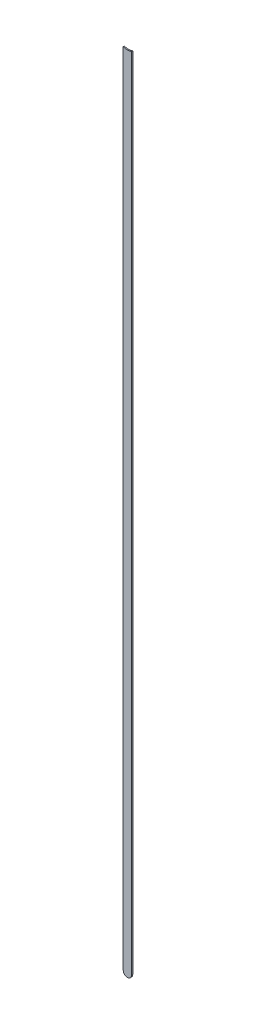
ISO-10303-21;
HEADER;
FILE_DESCRIPTION(('STEP AP214'),'2;1');
FILE_NAME('part.step','',(''),(''),'','','');
FILE_SCHEMA(('AUTOMOTIVE_DESIGN { 1 0 10303 214 1 1 1 1 }'));
ENDSEC;
DATA;
#1=APPLICATION_CONTEXT('core data for automotive mechanical design processes');
#2=APPLICATION_PROTOCOL_DEFINITION('international standard','automotive_design',2000,#1);
#3=PRODUCT_CONTEXT('',#1,'mechanical');
#4=PRODUCT('Part','Part','',(#3));
#5=PRODUCT_RELATED_PRODUCT_CATEGORY('part','',(#4));
#6=PRODUCT_DEFINITION_FORMATION('','',#4);
#7=PRODUCT_DEFINITION_CONTEXT('part definition',#1,'design');
#8=PRODUCT_DEFINITION('design','',#6,#7);
#9=PRODUCT_DEFINITION_SHAPE('','',#8);
#10=(LENGTH_UNIT() NAMED_UNIT(*) SI_UNIT(.MILLI.,.METRE.));
#11=(NAMED_UNIT(*) PLANE_ANGLE_UNIT() SI_UNIT($,.RADIAN.));
#12=(NAMED_UNIT(*) SI_UNIT($,.STERADIAN.) SOLID_ANGLE_UNIT());
#13=UNCERTAINTY_MEASURE_WITH_UNIT(LENGTH_MEASURE(1.E-05),#10,'distance_accuracy_value','');
#14=(GEOMETRIC_REPRESENTATION_CONTEXT(3) GLOBAL_UNCERTAINTY_ASSIGNED_CONTEXT((#13)) GLOBAL_UNIT_ASSIGNED_CONTEXT((#10,
#11,#12)) REPRESENTATION_CONTEXT('',''));
#15=CARTESIAN_POINT('',(0.,0.,0.));
#16=DIRECTION('',(0.,0.,1.));
#17=DIRECTION('',(1.,0.,0.));
#18=AXIS2_PLACEMENT_3D('',#15,#16,#17);
#19=CARTESIAN_POINT('',(90.34397222,59.48697526,0.));
#20=DIRECTION('',(-1.,0.,0.));
#21=DIRECTION('',(0.,1.,0.));
#22=AXIS2_PLACEMENT_3D('',#19,#20,#21);
#23=PLANE('',#22);
#24=DIRECTION('',(0.,1.,0.));
#25=VECTOR('',#24,1.);
#26=CARTESIAN_POINT('',(90.34397222,59.48697526,0.03556));
#27=LINE('',#26,#25);
#28=CARTESIAN_POINT('',(90.34397222,59.48697526,0.03556));
#29=VERTEX_POINT('',#28);
#30=CARTESIAN_POINT('',(90.34397222,83.8548234805022,0.03556));
#31=VERTEX_POINT('',#30);
#32=EDGE_CURVE('E11',#29,#31,#27,.T.);
#33=ORIENTED_EDGE('',*,*,#32,.F.);
#34=DIRECTION('',(0.,0.,1.));
#35=VECTOR('',#34,1.);
#36=CARTESIAN_POINT('',(90.34397222,59.48697526,0.));
#37=LINE('',#36,#35);
#38=CARTESIAN_POINT('',(90.34397222,59.48697526,0.));
#39=VERTEX_POINT('',#38);
#40=EDGE_CURVE('E24',#39,#29,#37,.T.);
#41=ORIENTED_EDGE('',*,*,#40,.F.);
#42=DIRECTION('',(0.,1.,0.));
#43=VECTOR('',#42,1.);
#44=CARTESIAN_POINT('',(90.34397222,59.48697526,0.));
#45=LINE('',#44,#43);
#46=CARTESIAN_POINT('',(90.34397222,83.8548234805022,0.));
#47=VERTEX_POINT('',#46);
#48=EDGE_CURVE('E75',#39,#47,#45,.T.);
#49=ORIENTED_EDGE('',*,*,#48,.T.);
#50=DIRECTION('',(0.,0.,1.));
#51=VECTOR('',#50,1.);
#52=CARTESIAN_POINT('',(90.34397222,83.8548234805022,0.));
#53=LINE('',#52,#51);
#54=EDGE_CURVE('E37',#47,#31,#53,.T.);
#55=ORIENTED_EDGE('',*,*,#54,.T.);
#56=EDGE_LOOP('',(#33,#41,#49,#55));
#57=FACE_BOUND('',#56,.T.);
#58=ADVANCED_FACE('F17',(#57),#23,.F.);
#59=CARTESIAN_POINT('',(90.21697222,84.18697158,0.));
#60=DIRECTION('',(0.,0.,-1.));
#61=DIRECTION('',(1.,0.,0.));
#62=AXIS2_PLACEMENT_3D('',#59,#60,#61);
#63=CYLINDRICAL_SURFACE('',#62,0.3556);
#64=DIRECTION('',(0.,0.,1.));
#65=VECTOR('',#64,1.);
#66=CARTESIAN_POINT('',(90.08997222,83.8548234805022,0.));
#67=LINE('',#66,#65);
#68=CARTESIAN_POINT('',(90.08997222,83.8548234805022,0.));
#69=VERTEX_POINT('',#68);
#70=CARTESIAN_POINT('',(90.08997222,83.8548234805022,0.03556));
#71=VERTEX_POINT('',#70);
#72=EDGE_CURVE('E67',#69,#71,#67,.T.);
#73=ORIENTED_EDGE('',*,*,#72,.T.);
#74=CARTESIAN_POINT('',(90.21697222,84.18697158,0.03556));
#75=DIRECTION('',(0.,0.,1.));
#76=DIRECTION('',(1.,0.,0.));
#77=AXIS2_PLACEMENT_3D('',#74,#75,#76);
#78=CIRCLE('',#77,0.3556);
#79=EDGE_CURVE('E82',#71,#31,#78,.T.);
#80=ORIENTED_EDGE('',*,*,#79,.T.);
#81=ORIENTED_EDGE('',*,*,#54,.F.);
#82=CARTESIAN_POINT('',(90.21697222,84.18697158,0.));
#83=DIRECTION('',(0.,0.,1.));
#84=DIRECTION('',(1.,0.,0.));
#85=AXIS2_PLACEMENT_3D('',#82,#83,#84);
#86=CIRCLE('',#85,0.3556);
#87=EDGE_CURVE('E80',#69,#47,#86,.T.);
#88=ORIENTED_EDGE('',*,*,#87,.F.);
#89=EDGE_LOOP('',(#73,#80,#81,#88));
#90=FACE_BOUND('',#89,.T.);
#91=ADVANCED_FACE('F88',(#90),#63,.F.);
#92=CARTESIAN_POINT('',(90.08997222,83.8548234805022,0.));
#93=DIRECTION('',(1.,0.,0.));
#94=DIRECTION('',(0.,-1.,0.));
#95=AXIS2_PLACEMENT_3D('',#92,#93,#94);
#96=PLANE('',#95);
#97=DIRECTION('',(0.,-1.,0.));
#98=VECTOR('',#97,1.);
#99=CARTESIAN_POINT('',(90.08997222,84.18697158,0.03556));
#100=LINE('',#99,#98);
#101=CARTESIAN_POINT('',(90.08997222,59.48697526,0.03556));
#102=VERTEX_POINT('',#101);
#103=EDGE_CURVE('E71',#71,#102,#100,.T.);
#104=ORIENTED_EDGE('',*,*,#103,.F.);
#105=ORIENTED_EDGE('',*,*,#72,.F.);
#106=DIRECTION('',(0.,-1.,0.));
#107=VECTOR('',#106,1.);
#108=CARTESIAN_POINT('',(90.08997222,84.18697158,0.));
#109=LINE('',#108,#107);
#110=CARTESIAN_POINT('',(90.08997222,59.48697526,0.));
#111=VERTEX_POINT('',#110);
#112=EDGE_CURVE('E63',#69,#111,#109,.T.);
#113=ORIENTED_EDGE('',*,*,#112,.T.);
#114=DIRECTION('',(0.,0.,1.));
#115=VECTOR('',#114,1.);
#116=CARTESIAN_POINT('',(90.08997222,59.48697526,0.));
#117=LINE('',#116,#115);
#118=EDGE_CURVE('E53',#111,#102,#117,.T.);
#119=ORIENTED_EDGE('',*,*,#118,.T.);
#120=EDGE_LOOP('',(#104,#105,#113,#119));
#121=FACE_BOUND('',#120,.T.);
#122=ADVANCED_FACE('F66',(#121),#96,.F.);
#123=CARTESIAN_POINT('',(90.21697222,59.48697526,0.));
#124=DIRECTION('',(0.,0.,-1.));
#125=DIRECTION('',(-1.,0.,0.));
#126=AXIS2_PLACEMENT_3D('',#123,#124,#125);
#127=CYLINDRICAL_SURFACE('',#126,0.127000000000005);
#128=CARTESIAN_POINT('',(90.21697222,59.48697526,0.03556));
#129=DIRECTION('',(0.,0.,1.));
#130=DIRECTION('',(-1.,0.,0.));
#131=AXIS2_PLACEMENT_3D('',#128,#129,#130);
#132=CIRCLE('',#131,0.127000000000005);
#133=EDGE_CURVE('E59',#102,#29,#132,.T.);
#134=ORIENTED_EDGE('',*,*,#133,.F.);
#135=ORIENTED_EDGE('',*,*,#118,.F.);
#136=CARTESIAN_POINT('',(90.21697222,59.48697526,0.));
#137=DIRECTION('',(0.,0.,1.));
#138=DIRECTION('',(-1.,0.,0.));
#139=AXIS2_PLACEMENT_3D('',#136,#137,#138);
#140=CIRCLE('',#139,0.127000000000005);
#141=EDGE_CURVE('E57',#111,#39,#140,.T.);
#142=ORIENTED_EDGE('',*,*,#141,.T.);
#143=ORIENTED_EDGE('',*,*,#40,.T.);
#144=EDGE_LOOP('',(#134,#135,#142,#143));
#145=FACE_BOUND('',#144,.T.);
#146=ADVANCED_FACE('F55',(#145),#127,.T.);
#147=CARTESIAN_POINT('',(90.34397222,59.48697526,0.));
#148=DIRECTION('',(0.,0.,-1.));
#149=DIRECTION('',(-1.,0.,0.));
#150=AXIS2_PLACEMENT_3D('',#147,#148,#149);
#151=PLANE('',#150);
#152=ORIENTED_EDGE('',*,*,#48,.F.);
#153=ORIENTED_EDGE('',*,*,#141,.F.);
#154=ORIENTED_EDGE('',*,*,#112,.F.);
#155=ORIENTED_EDGE('',*,*,#87,.T.);
#156=EDGE_LOOP('',(#152,#153,#154,#155));
#157=FACE_BOUND('',#156,.T.);
#158=ADVANCED_FACE('F74',(#157),#151,.T.);
#159=CARTESIAN_POINT('',(90.34397222,59.48697526,0.03556));
#160=DIRECTION('',(0.,0.,-1.));
#161=DIRECTION('',(-1.,0.,0.));
#162=AXIS2_PLACEMENT_3D('',#159,#160,#161);
#163=PLANE('',#162);
#164=ORIENTED_EDGE('',*,*,#133,.T.);
#165=ORIENTED_EDGE('',*,*,#32,.T.);
#166=ORIENTED_EDGE('',*,*,#79,.F.);
#167=ORIENTED_EDGE('',*,*,#103,.T.);
#168=EDGE_LOOP('',(#164,#165,#166,#167));
#169=FACE_BOUND('',#168,.T.);
#170=ADVANCED_FACE('F91',(#169),#163,.F.);
#171=CLOSED_SHELL('',(#58,#91,#122,#146,#158,#170));
#172=MANIFOLD_SOLID_BREP('B1',#171);
#173=ADVANCED_BREP_SHAPE_REPRESENTATION('',(#18,#172),#14);
#174=SHAPE_DEFINITION_REPRESENTATION(#9,#173);
ENDSEC;
END-ISO-10303-21;
